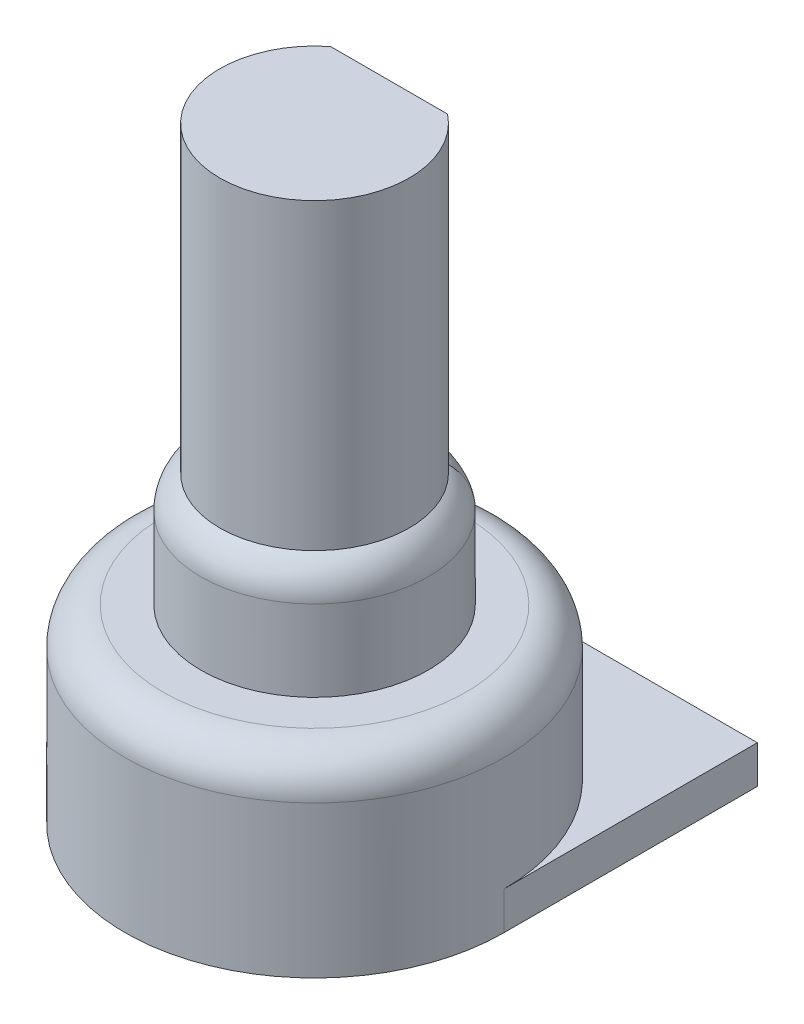
ISO-10303-21;
HEADER;
FILE_DESCRIPTION(('STEP AP214'),'2;1');
FILE_NAME('part.step','',(''),(''),'','','');
FILE_SCHEMA(('AUTOMOTIVE_DESIGN { 1 0 10303 214 1 1 1 1 }'));
ENDSEC;
DATA;
#1=APPLICATION_CONTEXT('core data for automotive mechanical design processes');
#2=APPLICATION_PROTOCOL_DEFINITION('international standard','automotive_design',2000,#1);
#3=PRODUCT_CONTEXT('',#1,'mechanical');
#4=PRODUCT('Part','Part','',(#3));
#5=PRODUCT_RELATED_PRODUCT_CATEGORY('part','',(#4));
#6=PRODUCT_DEFINITION_FORMATION('','',#4);
#7=PRODUCT_DEFINITION_CONTEXT('part definition',#1,'design');
#8=PRODUCT_DEFINITION('design','',#6,#7);
#9=PRODUCT_DEFINITION_SHAPE('','',#8);
#10=(LENGTH_UNIT() NAMED_UNIT(*) SI_UNIT(.MILLI.,.METRE.));
#11=(NAMED_UNIT(*) PLANE_ANGLE_UNIT() SI_UNIT($,.RADIAN.));
#12=(NAMED_UNIT(*) SI_UNIT($,.STERADIAN.) SOLID_ANGLE_UNIT());
#13=UNCERTAINTY_MEASURE_WITH_UNIT(LENGTH_MEASURE(1.E-05),#10,'distance_accuracy_value','');
#14=(GEOMETRIC_REPRESENTATION_CONTEXT(3) GLOBAL_UNCERTAINTY_ASSIGNED_CONTEXT((#13)) GLOBAL_UNIT_ASSIGNED_CONTEXT((#10,
#11,#12)) REPRESENTATION_CONTEXT('',''));
#15=CARTESIAN_POINT('',(0.,0.,0.));
#16=DIRECTION('',(0.,0.,1.));
#17=DIRECTION('',(1.,0.,0.));
#18=AXIS2_PLACEMENT_3D('',#15,#16,#17);
#19=CARTESIAN_POINT('',(0.,4.,0.));
#20=DIRECTION('',(0.,-1.,0.));
#21=DIRECTION('',(0.,0.,-1.));
#22=AXIS2_PLACEMENT_3D('',#19,#20,#21);
#23=CYLINDRICAL_SURFACE('',#22,5.);
#24=CARTESIAN_POINT('',(0.,3.,0.));
#25=DIRECTION('',(0.,1.,0.));
#26=DIRECTION('',(0.,0.,1.));
#27=AXIS2_PLACEMENT_3D('',#24,#25,#26);
#28=CIRCLE('',#27,5.);
#29=CARTESIAN_POINT('',(0.,3.,5.));
#30=VERTEX_POINT('',#29);
#31=EDGE_CURVE('E11',#30,#30,#28,.F.);
#32=ORIENTED_EDGE('',*,*,#31,.T.);
#33=EDGE_LOOP('',(#32));
#34=FACE_BOUND('',#33,.T.);
#35=CARTESIAN_POINT('',(0.,0.,0.));
#36=DIRECTION('',(0.,1.,0.));
#37=DIRECTION('',(0.,0.,1.));
#38=AXIS2_PLACEMENT_3D('',#35,#36,#37);
#39=CIRCLE('',#38,5.);
#40=CARTESIAN_POINT('',(5.,0.,0.));
#41=VERTEX_POINT('',#40);
#42=CARTESIAN_POINT('',(-5.,0.,0.));
#43=VERTEX_POINT('',#42);
#44=EDGE_CURVE('E140',#41,#43,#39,.T.);
#45=ORIENTED_EDGE('',*,*,#44,.T.);
#46=DIRECTION('',(0.,1.,0.));
#47=VECTOR('',#46,1.);
#48=CARTESIAN_POINT('',(-5.,-1.,0.));
#49=LINE('',#48,#47);
#50=CARTESIAN_POINT('',(-5.,-1.,0.));
#51=VERTEX_POINT('',#50);
#52=EDGE_CURVE('E122',#51,#43,#49,.T.);
#53=ORIENTED_EDGE('',*,*,#52,.F.);
#54=CARTESIAN_POINT('',(0.,-1.,0.));
#55=DIRECTION('',(0.,-1.,0.));
#56=DIRECTION('',(0.,0.,-1.));
#57=AXIS2_PLACEMENT_3D('',#54,#55,#56);
#58=CIRCLE('',#57,5.);
#59=CARTESIAN_POINT('',(5.,-1.,0.));
#60=VERTEX_POINT('',#59);
#61=EDGE_CURVE('E129',#60,#51,#58,.T.);
#62=ORIENTED_EDGE('',*,*,#61,.F.);
#63=DIRECTION('',(0.,1.,0.));
#64=VECTOR('',#63,1.);
#65=CARTESIAN_POINT('',(5.,-1.,0.));
#66=LINE('',#65,#64);
#67=EDGE_CURVE('E440',#60,#41,#66,.T.);
#68=ORIENTED_EDGE('',*,*,#67,.T.);
#69=EDGE_LOOP('',(#45,#53,#62,#68));
#70=FACE_BOUND('',#69,.T.);
#71=ADVANCED_FACE('F41',(#34,#70),#23,.T.);
#72=CARTESIAN_POINT('',(0.,4.,0.));
#73=DIRECTION('',(0.,1.,0.));
#74=DIRECTION('',(0.,0.,1.));
#75=AXIS2_PLACEMENT_3D('',#72,#73,#74);
#76=PLANE('',#75);
#77=CARTESIAN_POINT('',(0.,4.,0.));
#78=DIRECTION('',(0.,1.,0.));
#79=DIRECTION('',(0.,0.,1.));
#80=AXIS2_PLACEMENT_3D('',#77,#78,#79);
#81=CIRCLE('',#80,4.);
#82=CARTESIAN_POINT('',(0.,4.,4.));
#83=VERTEX_POINT('',#82);
#84=EDGE_CURVE('E55',#83,#83,#81,.T.);
#85=ORIENTED_EDGE('',*,*,#84,.T.);
#86=EDGE_LOOP('',(#85));
#87=FACE_BOUND('',#86,.T.);
#88=CARTESIAN_POINT('',(0.,4.,0.));
#89=DIRECTION('',(0.,1.,0.));
#90=DIRECTION('',(0.,0.,1.));
#91=AXIS2_PLACEMENT_3D('',#88,#89,#90);
#92=CIRCLE('',#91,3.);
#93=CARTESIAN_POINT('',(0.,4.,3.));
#94=VERTEX_POINT('',#93);
#95=EDGE_CURVE('E166',#94,#94,#92,.T.);
#96=ORIENTED_EDGE('',*,*,#95,.F.);
#97=EDGE_LOOP('',(#96));
#98=FACE_BOUND('',#97,.T.);
#99=ADVANCED_FACE('F261',(#87,#98),#76,.T.);
#100=CARTESIAN_POINT('',(0.,7.,0.));
#101=DIRECTION('',(0.,-1.,0.));
#102=DIRECTION('',(0.,0.,-1.));
#103=AXIS2_PLACEMENT_3D('',#100,#101,#102);
#104=CYLINDRICAL_SURFACE('',#103,3.);
#105=CARTESIAN_POINT('',(0.520536730955205,6.00000185481496,-2.95449513652104));
#106=CARTESIAN_POINT('',(0.520866478677693,7.00190042560644,-2.95443704002957));
#107=CARTESIAN_POINT('',(0.34702448730347,7.,-1.96773738528131));
#108=CARTESIAN_POINT('',(0.441593581367729,6.00004804070776,-2.96840982371977));
#109=CARTESIAN_POINT('',(0.443111767542616,7.01117760918691,-2.96816485333394));
#110=CARTESIAN_POINT('',(0.294395720911826,7.,-1.96773738528131));
#111=CARTESIAN_POINT('',(0.362095419441794,6.00016338038876,-2.97914757543754));
#112=CARTESIAN_POINT('',(0.364266822784042,7.0185579670105,-2.97888568402042));
#113=CARTESIAN_POINT('',(0.241396946294536,7.,-1.96773738528131));
#114=CARTESIAN_POINT('',(0.202507229943598,6.00038369481147,-2.99422867682402));
#115=CARTESIAN_POINT('',(0.204408943881679,7.02913501711683,-2.99410586400433));
#116=CARTESIAN_POINT('',(0.135004819962402,7.,-1.96773738528131));
#117=CARTESIAN_POINT('',(0.122417296463766,6.0004886711644,-2.99857302196224));
#118=CARTESIAN_POINT('',(0.123726572542678,7.0322880414774,-2.99854136217971));
#119=CARTESIAN_POINT('',(0.081611530975844,7.,-1.96773738528131));
#120=CARTESIAN_POINT('',(-0.0380014128020886,6.00053973802375,-3.00083311274722));
#121=CARTESIAN_POINT('',(-0.0384429477929129,7.03392549619115,-3.00085257577568));
#122=CARTESIAN_POINT('',(-0.0253342752013923,7.,-1.96773738528131));
#123=CARTESIAN_POINT('',(-0.118330361291309,6.00048555017604,-2.99873759575255));
#124=CARTESIAN_POINT('',(-0.119563078182976,7.03239431842228,-2.99870633664577));
#125=CARTESIAN_POINT('',(-0.0788869075275358,7.,-1.96773738528131));
#126=CARTESIAN_POINT('',(-0.278540894734522,6.00029204223053,-2.98812245021221));
#127=CARTESIAN_POINT('',(-0.280797306740903,7.02483286094368,-2.98792258937905));
#128=CARTESIAN_POINT('',(-0.185693929823019,7.,-1.96773738528131));
#129=CARTESIAN_POINT('',(-0.358422422762836,6.00015271153754,-2.97960202211978));
#130=CARTESIAN_POINT('',(-0.360561317383512,7.01883509205709,-2.97933171153417));
#131=CARTESIAN_POINT('',(-0.238948281841907,7.,-1.96773738528131));
#132=CARTESIAN_POINT('',(-0.604916968273584,5.99986136136218,-2.94321134432996));
#133=CARTESIAN_POINT('',(-0.603321973028898,6.99424585385075,-2.94335285985292));
#134=CARTESIAN_POINT('',(-0.403277978849022,7.,-1.96773738528131));
#135=CARTESIAN_POINT('',(-0.770116120244987,5.99986450826658,-2.90436493879673));
#136=CARTESIAN_POINT('',(-0.761399531485154,6.96929003646405,-2.90604258476055));
#137=CARTESIAN_POINT('',(-0.513410746829803,7.,-1.96773738528131));
#138=CARTESIAN_POINT('',(-1.0107665612959,6.00337649365589,-2.82586306249988));
#139=CARTESIAN_POINT('',(-0.985816481229574,6.92682606879379,-2.83457367755046));
#140=CARTESIAN_POINT('',(-0.673844374197358,7.,-1.96773738528131));
#141=CARTESIAN_POINT('',(-1.089755064957,6.00512998409455,-2.79634312323572));
#142=CARTESIAN_POINT('',(-1.0574304549066,6.91209134671317,-2.80865348995189));
#143=CARTESIAN_POINT('',(-0.726503376638275,7.,-1.96773738528131));
#144=CARTESIAN_POINT('',(-1.2449679604129,6.01064829669748,-2.73077804190997));
#145=CARTESIAN_POINT('',(-1.1955612347157,6.88273379459544,-2.75296957265926));
#146=CARTESIAN_POINT('',(-0.829978640275815,7.,-1.96773738528131));
#147=CARTESIAN_POINT('',(-1.32118868440509,6.01441569071306,-2.6947245952484));
#148=CARTESIAN_POINT('',(-1.26204903395089,6.86813199229922,-2.72330778010455));
#149=CARTESIAN_POINT('',(-0.880792456270707,7.,-1.96773738528131));
#150=CARTESIAN_POINT('',(-1.49683889255242,6.02680002500112,-2.60240946048128));
#151=CARTESIAN_POINT('',(-1.41222656205397,6.83568607536007,-2.65020284238384));
#152=CARTESIAN_POINT('',(-0.997892595034067,7.,-1.96773738528131));
#153=CARTESIAN_POINT('',(-1.59473599739624,6.0366751762618,-2.54354702756349));
#154=CARTESIAN_POINT('',(-1.49425235326483,6.81838537266106,-2.60547222437865));
#155=CARTESIAN_POINT('',(-1.06315733159436,7.,-1.96773738528131));
#156=CARTESIAN_POINT('',(-1.78127176172879,6.06472466658216,-2.4165509511928));
#157=CARTESIAN_POINT('',(-1.64789697761353,6.79029276924094,-2.51365413541539));
#158=CARTESIAN_POINT('',(-1.18751450782232,7.,-1.96773738528131));
#159=CARTESIAN_POINT('',(-1.86993388273407,6.08287731199141,-2.34844186700449));
#160=CARTESIAN_POINT('',(-1.71989389678099,6.77931893660457,-2.46655075085646));
#161=CARTESIAN_POINT('',(-1.24662258850099,7.,-1.96773738528131));
#162=CARTESIAN_POINT('',(-2.01715536851535,6.12520709809932,-2.22223595737964));
#163=CARTESIAN_POINT('',(-1.83860248576504,6.76772090333514,-2.38339245479106));
#164=CARTESIAN_POINT('',(-1.34477024566784,7.,-1.96773738528131));
#165=CARTESIAN_POINT('',(-2.07804915740135,6.1471850960162,-2.16522603471619));
#166=CARTESIAN_POINT('',(-1.88746173995959,6.76526595340393,-2.34720413326324));
#167=CARTESIAN_POINT('',(-1.38536610490388,7.,-1.96773738528131));
#168=CARTESIAN_POINT('',(-2.19106502130115,6.19908935175777,-2.05077493747291));
#169=CARTESIAN_POINT('',(-1.97805803521656,6.76631377875432,-2.27734965434905));
#170=CARTESIAN_POINT('',(-1.46071001423106,7.,-1.96773738528131));
#171=CARTESIAN_POINT('',(-2.24320347633979,6.22900049099406,-1.99333478304363));
#172=CARTESIAN_POINT('',(-2.02003387684532,6.76973929277149,-2.24353871025836));
#173=CARTESIAN_POINT('',(-1.49546898433857,7.,-1.96773738528131));
#174=CARTESIAN_POINT('',(-2.33783734794184,6.29744918290336,-1.8814639285082));
#175=CARTESIAN_POINT('',(-2.09658664625594,6.78234524835363,-2.18021950981289));
#176=CARTESIAN_POINT('',(-1.55855823184881,7.,-1.96773738528131));
#177=CARTESIAN_POINT('',(-2.38030021219654,6.33601501413118,-1.827043840268));
#178=CARTESIAN_POINT('',(-2.13133408945241,6.79152127164996,-2.15057868326884));
#179=CARTESIAN_POINT('',(-1.58686680771112,7.,-1.96773738528131));
#180=CARTESIAN_POINT('',(-2.43630868322114,6.4000538182913,-1.75083485079543));
#181=CARTESIAN_POINT('',(-2.17764823858885,6.80887640415052,-2.11053771162167));
#182=CARTESIAN_POINT('',(-1.62420578902638,7.,-1.96773738528131));
#183=CARTESIAN_POINT('',(-2.45377095581173,6.42257172549462,-1.72621631559289));
#184=CARTESIAN_POINT('',(-2.19218074302713,6.81529733628159,-2.09787211883546));
#185=CARTESIAN_POINT('',(-1.63584730448495,7.,-1.96773738528131));
#186=CARTESIAN_POINT('',(-2.48606625164954,6.4695056951382,-1.6793685612786));
#187=CARTESIAN_POINT('',(-2.21922788421847,6.82915316210739,-2.07419157865265));
#188=CARTESIAN_POINT('',(-1.65737750200288,7.,-1.96773738528131));
#189=CARTESIAN_POINT('',(-2.50089687105642,6.4939234639934,-1.65714153387007));
#190=CARTESIAN_POINT('',(-2.23175293189512,6.83659196409174,-2.06316759696406));
#191=CARTESIAN_POINT('',(-1.66726458150155,7.,-1.96773738528131));
#192=CARTESIAN_POINT('',(-2.51442587267734,6.51920505821258,-1.63635648035835));
#193=CARTESIAN_POINT('',(-2.24325860856835,6.84444657878525,-2.053032182067));
#194=CARTESIAN_POINT('',(-1.67628391511823,7.,-1.96773738528131));
#195=(BOUNDED_SURFACE() B_SPLINE_SURFACE(3,2,((#105,#106,#107),(#108,#109,#110),(#111,#112,
#113),(#114,#115,#116),(#117,#118,#119),(#120,#121,#122),(#123,#124,#125),(#126,#127,#128),
(#129,#130,#131),(#132,#133,#134),(#135,#136,#137),(#138,#139,#140),(#141,#142,#143),(#144,#145,
#146),(#147,#148,#149),(#150,#151,#152),(#153,#154,#155),(#156,#157,#158),(#159,#160,#161),
(#162,#163,#164),(#165,#166,#167),(#168,#169,#170),(#171,#172,#173),(#174,#175,#176),(#177,#178,
#179),(#180,#181,#182),(#183,#184,#185),(#186,#187,#188),(#189,#190,#191),(#192,#193,#194)),
.UNSPECIFIED.,.F.,.F.,.F.) B_SPLINE_SURFACE_WITH_KNOTS((4,2,2,2,2,2,2,2,2,2,2,2,2,2,4),(3,3),
(0.,0.160271522001961,0.320518086682756,0.481045065139428,0.641592023640548,0.97903210574132,
1.14758716675788,1.31635799669957,1.5459359947314,1.77491574267151,1.95359898264478,
2.13194411373039,2.31088068523095,2.40134046753742,2.49188245820315),(0.,1.),
.UNSPECIFIED.) GEOMETRIC_REPRESENTATION_ITEM() RATIONAL_B_SPLINE_SURFACE(((1.,0.706435834187672,
1.),(1.,0.703185029715501,1.),(1.,0.70063355501786,1.),(1.,0.697018580903054,1.),(1.,
0.695954849841734,1.),(1.,0.695403128588577,1.),(1.,0.695917899026356,1.),(1.,0.698484075012688,
1.),(1.,0.700535671811073,1.),(1.,0.709123066734792,1.),(1.,0.718108994217175,1.),(1.,
0.734562553880553,1.),(1.,0.740539198644847,1.),(1.,0.753102901283008,1.),(1.,0.759690730758651,
1.),(1.,0.775479132783039,1.),(1.,0.784765882562336,1.),(1.,0.802612772782072,1.),(1.,
0.811174743608809,1.),(1.,0.824906148705264,1.),(1.,0.830407669954603,1.),(1.,0.840030863544463,
1.),(1.,0.844155127171257,1.),(1.,0.85092578889602,1.),(1.,0.853567240637306,1.),(1.,
0.856545417498974,1.),(1.,0.857375927704215,1.),(1.,0.858752845010317,1.),(1.,0.859298993237049,
1.),(1.,0.859729750965828,1.))) REPRESENTATION_ITEM('') SURFACE());
#196=CARTESIAN_POINT('',(-2.51442587267734,6.51920505821258,-1.63635648035835));
#197=CARTESIAN_POINT('',(-2.50089687105642,6.4939234639934,-1.65714153387007));
#198=CARTESIAN_POINT('',(-2.48606625164954,6.4695056951382,-1.6793685612786));
#199=CARTESIAN_POINT('',(-2.45377095581173,6.42257172549462,-1.72621631559289));
#200=CARTESIAN_POINT('',(-2.43630868322114,6.4000538182913,-1.75083485079543));
#201=CARTESIAN_POINT('',(-2.38030021219654,6.33601501413118,-1.827043840268));
#202=CARTESIAN_POINT('',(-2.33783734794184,6.29744918290336,-1.8814639285082));
#203=CARTESIAN_POINT('',(-2.24320347633979,6.22900049099406,-1.99333478304363));
#204=CARTESIAN_POINT('',(-2.19106502130115,6.19908935175777,-2.05077493747291));
#205=CARTESIAN_POINT('',(-2.07804915740135,6.1471850960162,-2.16522603471619));
#206=CARTESIAN_POINT('',(-2.01715536851535,6.12520709809932,-2.22223595737964));
#207=CARTESIAN_POINT('',(-1.86993388273407,6.08287731199141,-2.34844186700449));
#208=CARTESIAN_POINT('',(-1.78127176172879,6.06472466658216,-2.4165509511928));
#209=CARTESIAN_POINT('',(-1.59473599739624,6.0366751762618,-2.54354702756349));
#210=CARTESIAN_POINT('',(-1.49683889255242,6.02680002500112,-2.60240946048128));
#211=CARTESIAN_POINT('',(-1.32118868440509,6.01441569071306,-2.6947245952484));
#212=CARTESIAN_POINT('',(-1.2449679604129,6.01064829669748,-2.73077804190997));
#213=CARTESIAN_POINT('',(-1.089755064957,6.00512998409455,-2.79634312323572));
#214=CARTESIAN_POINT('',(-1.0107665612959,6.00337649365589,-2.82586306249988));
#215=CARTESIAN_POINT('',(-0.770116120244987,5.99986450826658,-2.90436493879673));
#216=CARTESIAN_POINT('',(-0.604916968273584,5.99986136136218,-2.94321134432996));
#217=CARTESIAN_POINT('',(-0.358422422762836,6.00015271153754,-2.97960202211978));
#218=CARTESIAN_POINT('',(-0.278540894734522,6.00029204223053,-2.98812245021221));
#219=CARTESIAN_POINT('',(-0.118330361291309,6.00048555017604,-2.99873759575255));
#220=CARTESIAN_POINT('',(-0.0380014128020886,6.00053973802375,-3.00083311274722));
#221=CARTESIAN_POINT('',(0.122417296463766,6.0004886711644,-2.99857302196224));
#222=CARTESIAN_POINT('',(0.202507229943598,6.00038369481147,-2.99422867682402));
#223=CARTESIAN_POINT('',(0.362095419441795,6.00016338038876,-2.97914757543754));
#224=CARTESIAN_POINT('',(0.441593581367729,6.00004804070776,-2.96840982371977));
#225=CARTESIAN_POINT('',(0.520536730955205,6.00000185481496,-2.95449513652104));
#226=B_SPLINE_CURVE_WITH_KNOTS('',3,(#196,#197,#198,#199,#200,#201,#202,#203,#204,#205,#206,
#207,#208,#209,#210,#211,#212,#213,#214,#215,#216,#217,#218,#219,#220,#221,#222,#223,#224,#225),
.UNSPECIFIED.,.F.,.F.,(4,2,2,2,2,2,2,2,2,2,2,2,2,2,4),(0.,0.0905419906657322,0.1810017729722,
0.359938344472757,0.538283475558371,0.716966715531638,0.945946463471746,1.17552446150357,
1.34429529144527,1.51285035246183,1.8502904345626,2.01083739306372,2.17136437152039,
2.33161093620119,2.49188245820315),.UNSPECIFIED.);
#227=CARTESIAN_POINT('',(-2.03787405834048,6.13397459621556,-2.20160607792196));
#228=VERTEX_POINT('',#227);
#229=CARTESIAN_POINT('',(-0.536676402289272,6.,-2.95160607792196));
#230=VERTEX_POINT('',#229);
#231=EDGE_CURVE('E173',#228,#230,#226,.T.);
#232=ORIENTED_EDGE('',*,*,#231,.T.);
#233=CARTESIAN_POINT('',(0.,6.,0.));
#234=DIRECTION('',(0.,1.,0.));
#235=DIRECTION('',(0.,0.,1.));
#236=AXIS2_PLACEMENT_3D('',#233,#234,#235);
#237=CIRCLE('',#236,3.);
#238=CARTESIAN_POINT('',(0.536676402289269,6.,-2.95160607792196));
#239=VERTEX_POINT('',#238);
#240=EDGE_CURVE('E63',#230,#239,#237,.F.);
#241=ORIENTED_EDGE('',*,*,#240,.T.);
#242=CARTESIAN_POINT('',(2.47355700829104,6.45137547886523,-1.69750279137747));
#243=CARTESIAN_POINT('',(2.20876389556524,6.82381001022166,-2.08335244243966));
#244=CARTESIAN_POINT('',(1.64903800552736,7.,-1.96773738528131));
#245=CARTESIAN_POINT('',(2.44733251521866,6.41237660553013,-1.73579194848286));
#246=CARTESIAN_POINT('',(2.18674017106704,6.81218867798672,-2.10261566673093));
#247=CARTESIAN_POINT('',(1.63155501014577,7.,-1.96773738528131));
#248=CARTESIAN_POINT('',(2.41739523176251,6.37608489503801,-1.77744574962143));
#249=CARTESIAN_POINT('',(2.16188522207287,6.80205103734026,-2.1242781030629));
#250=CARTESIAN_POINT('',(1.61159682117501,7.,-1.96773738528131));
#251=CARTESIAN_POINT('',(2.35060883924748,6.30935626636143,-1.86482526115536));
#252=CARTESIAN_POINT('',(2.10711195678218,6.78527986293987,-2.17117267834912));
#253=CARTESIAN_POINT('',(1.56707255949832,7.,-1.96773738528131));
#254=CARTESIAN_POINT('',(2.31380105032395,6.27888644327347,-1.91052581237447));
#255=CARTESIAN_POINT('',(2.07713894780983,6.77862336496292,-2.1964525843594));
#256=CARTESIAN_POINT('',(1.5425340335493,7.,-1.96773738528131));
#257=CARTESIAN_POINT('',(2.23110885048495,6.22215929305744,-2.00659147495118));
#258=CARTESIAN_POINT('',(2.01034643463258,6.76898997742828,-2.25131759488844));
#259=CARTESIAN_POINT('',(1.4874059003233,7.,-1.96773738528131));
#260=CARTESIAN_POINT('',(2.18481758478538,6.19625568234982,-2.05707279383417));
#261=CARTESIAN_POINT('',(1.97311029674358,6.76627393972283,-2.2811542502516));
#262=CARTESIAN_POINT('',(1.45654505652359,7.,-1.96773738528131));
#263=CARTESIAN_POINT('',(2.08550268730714,6.150573007243,-2.15770653906294));
#264=CARTESIAN_POINT('',(1.89349531163015,6.76531831108411,-2.3425623183965));
#265=CARTESIAN_POINT('',(1.39033512487143,7.,-1.96773738528131));
#266=CARTESIAN_POINT('',(2.03246938760342,6.13080288101934,-2.20785838213827));
#267=CARTESIAN_POINT('',(1.85095594473717,6.76712994761033,-2.37423140076883));
#268=CARTESIAN_POINT('',(1.35497959173561,7.,-1.96773738528131));
#269=CARTESIAN_POINT('',(1.89326601514172,6.08832806330656,-2.32974887150156));
#270=CARTESIAN_POINT('',(1.73873720892919,6.77682010631457,-2.4538883765447));
#271=CARTESIAN_POINT('',(1.26217734342782,7.,-1.96773738528131));
#272=CARTESIAN_POINT('',(1.80357276036745,6.0689152300912,-2.40005209637092));
#273=CARTESIAN_POINT('',(1.66603890205278,6.78735979660252,-2.50211979478377));
#274=CARTESIAN_POINT('',(1.20238184024497,7.,-1.96773738528131));
#275=CARTESIAN_POINT('',(1.61441369377795,6.03895865477583,-2.53121236180606));
#276=CARTESIAN_POINT('',(1.51059803137484,6.81507666501806,-2.59627554281819));
#277=CARTESIAN_POINT('',(1.07627579585197,7.,-1.96773738528131));
#278=CARTESIAN_POINT('',(1.51492221765999,6.02843893530166,-2.59204345681305));
#279=CARTESIAN_POINT('',(1.42744039443367,6.83245452991153,-2.64223197125601));
#280=CARTESIAN_POINT('',(1.00994814510666,7.,-1.96773738528131));
#281=CARTESIAN_POINT('',(1.27322515112109,6.01060609557221,-2.72094393029416));
#282=CARTESIAN_POINT('',(1.21981260413536,6.87718922290874,-2.74455053996177));
#283=CARTESIAN_POINT('',(0.848816767414059,7.,-1.96773738528131));
#284=CARTESIAN_POINT('',(1.12811556430418,6.00564748386512,-2.78428296274231));
#285=CARTESIAN_POINT('',(1.09177827622044,6.90580660233446,-2.79812042476473));
#286=CARTESIAN_POINT('',(0.752077042869453,7.,-1.96773738528131));
#287=CARTESIAN_POINT('',(0.829533125444094,6.00031931517094,-2.88736685976144));
#288=CARTESIAN_POINT('',(0.817517224886831,6.95937275856478,-2.890181390132));
#289=CARTESIAN_POINT('',(0.553022083629396,7.,-1.96773738528131));
#290=CARTESIAN_POINT('',(0.676052934802595,5.99995385217583,-2.92709064541832));
#291=CARTESIAN_POINT('',(0.671985743343665,6.98396363596031,-2.92778752557935));
#292=CARTESIAN_POINT('',(0.450701956535063,7.,-1.96773738528131));
#293=CARTESIAN_POINT('',(0.441469538297941,6.00002626020696,-2.96842806520685));
#294=CARTESIAN_POINT('',(0.442983533858985,7.0111445812164,-2.96817150775583));
#295=CARTESIAN_POINT('',(0.294313025531961,7.,-1.96773738528131));
#296=CARTESIAN_POINT('',(0.361876059497265,6.00015754173976,-2.97917659705195));
#297=CARTESIAN_POINT('',(0.364047347339577,7.01856509159885,-2.97891146304746));
#298=CARTESIAN_POINT('',(0.241250706331511,7.,-1.96773738528131));
#299=CARTESIAN_POINT('',(0.202062466337572,6.0003905116567,-2.99426239055293));
#300=CARTESIAN_POINT('',(0.203961637708663,7.02917215624139,-2.99414354981379));
#301=CARTESIAN_POINT('',(0.134708310891715,7.,-1.96773738528131));
#302=CARTESIAN_POINT('',(0.121842327480343,6.00049219887789,-2.99859940028752));
#303=CARTESIAN_POINT('',(0.123146193912136,7.03231359528539,-2.99857001453381));
#304=CARTESIAN_POINT('',(0.0812282183202294,7.,-1.96773738528131));
#305=CARTESIAN_POINT('',(-0.0385868351381965,6.00053655667531,-3.00082294970918));
#306=CARTESIAN_POINT('',(-0.0390341666076833,7.03391161601379,-3.00084045797569));
#307=CARTESIAN_POINT('',(-0.0257245567587984,7.,-1.96773738528131));
#308=CARTESIAN_POINT('',(-0.118795757442538,6.00047941729215,-2.9987171980421));
#309=CARTESIAN_POINT('',(-0.120031352353304,7.03236654805585,-2.99868206190195));
#310=CARTESIAN_POINT('',(-0.0791971716283609,7.,-1.96773738528131));
#311=CARTESIAN_POINT('',(-0.278789275926867,6.00029729287594,-2.98809548832386));
#312=CARTESIAN_POINT('',(-0.281048423115858,7.02482679994912,-2.9878987038736));
#313=CARTESIAN_POINT('',(-0.185859517284581,7.,-1.96773738528131));
#314=CARTESIAN_POINT('',(-0.358573864057783,6.00017230656052,-2.97957940911072));
#315=CARTESIAN_POINT('',(-0.36072191433987,7.0188646875014,-2.97932069384958));
#316=CARTESIAN_POINT('',(-0.239049242705191,7.,-1.96773738528131));
#317=CARTESIAN_POINT('',(-0.43789025293174,6.00005878261831,-2.96786996453473));
#318=CARTESIAN_POINT('',(-0.439472900905556,7.01084213405776,-2.96763645493699));
#319=CARTESIAN_POINT('',(-0.291926835287827,7.,-1.96773738528131));
#320=(BOUNDED_SURFACE() B_SPLINE_SURFACE(3,2,((#242,#243,#244),(#245,#246,#247),(#248,#249,
#250),(#251,#252,#253),(#254,#255,#256),(#257,#258,#259),(#260,#261,#262),(#263,#264,#265),
(#266,#267,#268),(#269,#270,#271),(#272,#273,#274),(#275,#276,#277),(#278,#279,#280),(#281,#282,
#283),(#284,#285,#286),(#287,#288,#289),(#290,#291,#292),(#293,#294,#295),(#296,#297,#298),
(#299,#300,#301),(#302,#303,#304),(#305,#306,#307),(#308,#309,#310),(#311,#312,#313),(#314,#315,
#316),(#317,#318,#319)),.UNSPECIFIED.,.F.,.F.,.F.) B_SPLINE_SURFACE_WITH_KNOTS((4,2,2,2,2,2,2,2,
2,2,2,2,4),(3,3),(0.,0.149019327834431,0.297169736367482,0.45404419467948,0.611146199929875,
0.845065417932731,1.07961451200912,1.39499610097889,1.71065877778202,1.87114727392607,
2.03164207581049,2.19194492373374,2.35225080162659),(0.,1.),
.UNSPECIFIED.) GEOMETRIC_REPRESENTATION_ITEM() RATIONAL_B_SPLINE_SURFACE(((1.,0.858218039479021,
1.),(1.,0.857141476498481,1.),(1.,0.855638621967276,1.),(1.,0.851697235496683,1.),(1.,
0.849264210510849,1.),(1.,0.843195425149899,1.),(1.,0.839497276760322,1.),(1.,0.83104394608383,
1.),(1.,0.82628723834639,1.),(1.,0.813400540456095,1.),(1.,0.804758397784339,1.),(1.,
0.786639711958819,1.),(1.,0.777160984669837,1.),(1.,0.755313548917098,1.),(1.,0.743074650659231,
1.),(1.,0.721823550456026,1.),(1.,0.712814234066578,1.),(1.,0.703192942710168,1.),(1.,
0.700630113080969,1.),(1.,0.697006952577283,1.),(1.,0.695946680741309,1.),(1.,0.695407351324499,
1.),(1.,0.695926404106621,1.),(1.,0.698487024215212,1.),(1.,0.700528620319356,1.),(1.,
0.703304177864533,1.))) REPRESENTATION_ITEM('') SURFACE());
#321=CARTESIAN_POINT('',(-0.43789025293174,6.00005878261831,-2.96786996453473));
#322=CARTESIAN_POINT('',(-0.358573864057783,6.00017230656052,-2.97957940911072));
#323=CARTESIAN_POINT('',(-0.278789275926867,6.00029729287594,-2.98809548832385));
#324=CARTESIAN_POINT('',(-0.118795757442538,6.00047941729215,-2.9987171980421));
#325=CARTESIAN_POINT('',(-0.0385868351381965,6.00053655667531,-3.00082294970918));
#326=CARTESIAN_POINT('',(0.121842327480343,6.00049219887789,-2.99859940028752));
#327=CARTESIAN_POINT('',(0.202062466337572,6.0003905116567,-2.99426239055293));
#328=CARTESIAN_POINT('',(0.361876059497265,6.00015754173976,-2.97917659705195));
#329=CARTESIAN_POINT('',(0.441469538297941,6.00002626020696,-2.96842806520685));
#330=CARTESIAN_POINT('',(0.676052934802595,5.99995385217583,-2.92709064541832));
#331=CARTESIAN_POINT('',(0.829533125444094,6.00031931517094,-2.88736685976144));
#332=CARTESIAN_POINT('',(1.12811556430418,6.00564748386512,-2.78428296274231));
#333=CARTESIAN_POINT('',(1.27322515112109,6.01060609557221,-2.72094393029416));
#334=CARTESIAN_POINT('',(1.51492221765999,6.02843893530166,-2.59204345681305));
#335=CARTESIAN_POINT('',(1.61441369377795,6.03895865477583,-2.53121236180606));
#336=CARTESIAN_POINT('',(1.80357276036745,6.0689152300912,-2.40005209637092));
#337=CARTESIAN_POINT('',(1.89326601514172,6.08832806330656,-2.32974887150155));
#338=CARTESIAN_POINT('',(2.03246938760342,6.13080288101934,-2.20785838213827));
#339=CARTESIAN_POINT('',(2.08550268730714,6.150573007243,-2.15770653906294));
#340=CARTESIAN_POINT('',(2.18481758478538,6.19625568234982,-2.05707279383417));
#341=CARTESIAN_POINT('',(2.23110885048495,6.22215929305744,-2.00659147495118));
#342=CARTESIAN_POINT('',(2.31380105032395,6.27888644327347,-1.91052581237447));
#343=CARTESIAN_POINT('',(2.35060883924748,6.30935626636143,-1.86482526115536));
#344=CARTESIAN_POINT('',(2.41739523176251,6.37608489503801,-1.77744574962143));
#345=CARTESIAN_POINT('',(2.44733251521866,6.41237660553013,-1.73579194848286));
#346=CARTESIAN_POINT('',(2.47355700829104,6.45137547886523,-1.69750279137747));
#347=B_SPLINE_CURVE_WITH_KNOTS('',3,(#321,#322,#323,#324,#325,#326,#327,#328,#329,#330,#331,
#332,#333,#334,#335,#336,#337,#338,#339,#340,#341,#342,#343,#344,#345,#346),.UNSPECIFIED.,.F.,
.F.,(4,2,2,2,2,2,2,2,2,2,2,2,4),(0.,0.160305877892846,0.320608725816097,0.481103527700511,
0.641592023844569,0.957254700647695,1.27263628961746,1.50718538369385,1.74110460169671,
1.89820660694711,2.0550810652591,2.20323147379215,2.35225080162659),.UNSPECIFIED.);
#348=CARTESIAN_POINT('',(2.03787405834047,6.13397459621556,-2.20160607792196));
#349=VERTEX_POINT('',#348);
#350=EDGE_CURVE('E67',#239,#349,#347,.T.);
#351=ORIENTED_EDGE('',*,*,#350,.T.);
#352=CARTESIAN_POINT('',(0.,6.13397459621556,0.));
#353=DIRECTION('',(0.,1.,0.));
#354=DIRECTION('',(0.,0.,1.));
#355=AXIS2_PLACEMENT_3D('',#352,#353,#354);
#356=CIRCLE('',#355,3.);
#357=EDGE_CURVE('E175',#349,#228,#356,.F.);
#358=ORIENTED_EDGE('',*,*,#357,.T.);
#359=EDGE_LOOP('',(#232,#241,#351,#358));
#360=FACE_BOUND('',#359,.T.);
#361=ORIENTED_EDGE('',*,*,#95,.T.);
#362=EDGE_LOOP('',(#361));
#363=FACE_BOUND('',#362,.T.);
#364=ADVANCED_FACE('F184',(#360,#363),#104,.T.);
#365=CARTESIAN_POINT('',(0.,7.,0.));
#366=DIRECTION('',(0.,1.,0.));
#367=DIRECTION('',(0.,0.,1.));
#368=AXIS2_PLACEMENT_3D('',#365,#366,#367);
#369=PLANE('',#368);
#370=DIRECTION('',(1.,0.,0.));
#371=VECTOR('',#370,1.);
#372=CARTESIAN_POINT('',(-1.96780354474308,7.,-1.96773738528131));
#373=LINE('',#372,#371);
#374=CARTESIAN_POINT('',(-0.357784268192847,7.,-1.96773738528131));
#375=VERTEX_POINT('',#374);
#376=CARTESIAN_POINT('',(0.357784268192847,7.,-1.96773738528131));
#377=VERTEX_POINT('',#376);
#378=EDGE_CURVE('E144',#375,#377,#373,.T.);
#379=ORIENTED_EDGE('',*,*,#378,.T.);
#380=CARTESIAN_POINT('',(0.,7.,0.));
#381=DIRECTION('',(0.,1.,0.));
#382=DIRECTION('',(0.,0.,1.));
#383=AXIS2_PLACEMENT_3D('',#380,#381,#382);
#384=CIRCLE('',#383,2.);
#385=EDGE_CURVE('E171',#377,#375,#384,.T.);
#386=ORIENTED_EDGE('',*,*,#385,.T.);
#387=EDGE_LOOP('',(#379,#386));
#388=FACE_BOUND('',#387,.T.);
#389=ADVANCED_FACE('F277',(#388),#369,.T.);
#390=CARTESIAN_POINT('',(0.,15.,0.));
#391=DIRECTION('',(0.,-1.,0.));
#392=DIRECTION('',(0.,0.,-1.));
#393=AXIS2_PLACEMENT_3D('',#390,#391,#392);
#394=CYLINDRICAL_SURFACE('',#393,2.5);
#395=CARTESIAN_POINT('',(0.,15.,0.));
#396=DIRECTION('',(0.,1.,0.));
#397=DIRECTION('',(0.,0.,1.));
#398=AXIS2_PLACEMENT_3D('',#395,#396,#397);
#399=CIRCLE('',#398,2.5);
#400=CARTESIAN_POINT('',(-1.54207962912629,15.,-1.96773738528131));
#401=VERTEX_POINT('',#400);
#402=CARTESIAN_POINT('',(1.54207962912629,15.,-1.96773738528131));
#403=VERTEX_POINT('',#402);
#404=EDGE_CURVE('E158',#401,#403,#399,.T.);
#405=ORIENTED_EDGE('',*,*,#404,.F.);
#406=DIRECTION('',(0.,-1.,0.));
#407=VECTOR('',#406,1.);
#408=CARTESIAN_POINT('',(-1.54207962912629,15.,-1.96773738528131));
#409=LINE('',#408,#407);
#410=CARTESIAN_POINT('',(-1.54207962912629,7.,-1.96773738528131));
#411=VERTEX_POINT('',#410);
#412=EDGE_CURVE('E155',#401,#411,#409,.T.);
#413=ORIENTED_EDGE('',*,*,#412,.T.);
#414=CARTESIAN_POINT('',(0.,7.,0.));
#415=DIRECTION('',(0.,1.,0.));
#416=DIRECTION('',(0.,0.,1.));
#417=AXIS2_PLACEMENT_3D('',#414,#415,#416);
#418=CIRCLE('',#417,2.5);
#419=CARTESIAN_POINT('',(1.54207962912629,7.,-1.96773738528131));
#420=VERTEX_POINT('',#419);
#421=EDGE_CURVE('E162',#411,#420,#418,.T.);
#422=ORIENTED_EDGE('',*,*,#421,.T.);
#423=DIRECTION('',(0.,-1.,0.));
#424=VECTOR('',#423,1.);
#425=CARTESIAN_POINT('',(1.54207962912629,15.,-1.96773738528131));
#426=LINE('',#425,#424);
#427=EDGE_CURVE('E152',#420,#403,#426,.F.);
#428=ORIENTED_EDGE('',*,*,#427,.T.);
#429=EDGE_LOOP('',(#405,#413,#422,#428));
#430=FACE_BOUND('',#429,.T.);
#431=ADVANCED_FACE('F281',(#430),#394,.T.);
#432=CARTESIAN_POINT('',(0.,15.,0.));
#433=DIRECTION('',(0.,1.,0.));
#434=DIRECTION('',(0.,0.,1.));
#435=AXIS2_PLACEMENT_3D('',#432,#433,#434);
#436=PLANE('',#435);
#437=DIRECTION('',(1.,0.,0.));
#438=VECTOR('',#437,1.);
#439=CARTESIAN_POINT('',(0.,15.,-1.96773738528131));
#440=LINE('',#439,#438);
#441=EDGE_CURVE('E165',#401,#403,#440,.T.);
#442=ORIENTED_EDGE('',*,*,#441,.F.);
#443=ORIENTED_EDGE('',*,*,#404,.T.);
#444=EDGE_LOOP('',(#442,#443));
#445=FACE_BOUND('',#444,.T.);
#446=ADVANCED_FACE('F286',(#445),#436,.T.);
#447=CARTESIAN_POINT('',(-1.96780354474308,7.,-1.96773738528131));
#448=DIRECTION('',(0.,0.,1.));
#449=DIRECTION('',(1.,0.,0.));
#450=AXIS2_PLACEMENT_3D('',#447,#448,#449);
#451=PLANE('',#450);
#452=ORIENTED_EDGE('',*,*,#441,.T.);
#453=ORIENTED_EDGE('',*,*,#427,.F.);
#454=EDGE_CURVE('E141',#377,#420,#373,.T.);
#455=ORIENTED_EDGE('',*,*,#454,.F.);
#456=ORIENTED_EDGE('',*,*,#378,.F.);
#457=EDGE_CURVE('E146',#411,#375,#373,.T.);
#458=ORIENTED_EDGE('',*,*,#457,.F.);
#459=ORIENTED_EDGE('',*,*,#412,.F.);
#460=EDGE_LOOP('',(#452,#453,#455,#456,#458,#459));
#461=FACE_BOUND('',#460,.T.);
#462=ADVANCED_FACE('F293',(#461),#451,.F.);
#463=CARTESIAN_POINT('',(-5.,-1.,0.));
#464=DIRECTION('',(1.,0.,0.));
#465=DIRECTION('',(0.,0.,-1.));
#466=AXIS2_PLACEMENT_3D('',#463,#464,#465);
#467=PLANE('',#466);
#468=DIRECTION('',(0.,0.,-1.));
#469=VECTOR('',#468,1.);
#470=CARTESIAN_POINT('',(-5.,0.,0.));
#471=LINE('',#470,#469);
#472=CARTESIAN_POINT('',(-5.,0.,-6.68645036232717));
#473=VERTEX_POINT('',#472);
#474=EDGE_CURVE('E228',#43,#473,#471,.T.);
#475=ORIENTED_EDGE('',*,*,#474,.T.);
#476=DIRECTION('',(0.,1.,0.));
#477=VECTOR('',#476,1.);
#478=CARTESIAN_POINT('',(-5.,-1.,-6.68645036232717));
#479=LINE('',#478,#477);
#480=CARTESIAN_POINT('',(-5.,-1.,-6.68645036232717));
#481=VERTEX_POINT('',#480);
#482=EDGE_CURVE('E125',#481,#473,#479,.T.);
#483=ORIENTED_EDGE('',*,*,#482,.F.);
#484=DIRECTION('',(0.,0.,-1.));
#485=VECTOR('',#484,1.);
#486=CARTESIAN_POINT('',(-5.,-1.,0.));
#487=LINE('',#486,#485);
#488=EDGE_CURVE('E118',#51,#481,#487,.T.);
#489=ORIENTED_EDGE('',*,*,#488,.F.);
#490=ORIENTED_EDGE('',*,*,#52,.T.);
#491=EDGE_LOOP('',(#475,#483,#489,#490));
#492=FACE_BOUND('',#491,.T.);
#493=ADVANCED_FACE('F120',(#492),#467,.F.);
#494=CARTESIAN_POINT('',(-5.,-1.,-6.68645036232717));
#495=DIRECTION('',(0.,0.,1.));
#496=DIRECTION('',(1.,0.,0.));
#497=AXIS2_PLACEMENT_3D('',#494,#495,#496);
#498=PLANE('',#497);
#499=DIRECTION('',(1.,0.,0.));
#500=VECTOR('',#499,1.);
#501=CARTESIAN_POINT('',(-5.,0.,-6.68645036232717));
#502=LINE('',#501,#500);
#503=CARTESIAN_POINT('',(5.,0.,-6.68645036232717));
#504=VERTEX_POINT('',#503);
#505=EDGE_CURVE('E433',#473,#504,#502,.T.);
#506=ORIENTED_EDGE('',*,*,#505,.T.);
#507=DIRECTION('',(0.,1.,0.));
#508=VECTOR('',#507,1.);
#509=CARTESIAN_POINT('',(5.,-1.,-6.68645036232717));
#510=LINE('',#509,#508);
#511=CARTESIAN_POINT('',(5.,-1.,-6.68645036232717));
#512=VERTEX_POINT('',#511);
#513=EDGE_CURVE('E147',#512,#504,#510,.T.);
#514=ORIENTED_EDGE('',*,*,#513,.F.);
#515=DIRECTION('',(1.,0.,0.));
#516=VECTOR('',#515,1.);
#517=CARTESIAN_POINT('',(-5.,-1.,-6.68645036232717));
#518=LINE('',#517,#516);
#519=EDGE_CURVE('E128',#481,#512,#518,.T.);
#520=ORIENTED_EDGE('',*,*,#519,.F.);
#521=ORIENTED_EDGE('',*,*,#482,.T.);
#522=EDGE_LOOP('',(#506,#514,#520,#521));
#523=FACE_BOUND('',#522,.T.);
#524=ADVANCED_FACE('F301',(#523),#498,.F.);
#525=CARTESIAN_POINT('',(5.,-1.,0.));
#526=DIRECTION('',(-1.,0.,0.));
#527=DIRECTION('',(0.,0.,1.));
#528=AXIS2_PLACEMENT_3D('',#525,#526,#527);
#529=PLANE('',#528);
#530=DIRECTION('',(0.,0.,1.));
#531=VECTOR('',#530,1.);
#532=CARTESIAN_POINT('',(5.,0.,0.));
#533=LINE('',#532,#531);
#534=EDGE_CURVE('E137',#504,#41,#533,.T.);
#535=ORIENTED_EDGE('',*,*,#534,.T.);
#536=ORIENTED_EDGE('',*,*,#67,.F.);
#537=DIRECTION('',(0.,0.,1.));
#538=VECTOR('',#537,1.);
#539=CARTESIAN_POINT('',(5.,-1.,0.));
#540=LINE('',#539,#538);
#541=EDGE_CURVE('E134',#512,#60,#540,.T.);
#542=ORIENTED_EDGE('',*,*,#541,.F.);
#543=ORIENTED_EDGE('',*,*,#513,.T.);
#544=EDGE_LOOP('',(#535,#536,#542,#543));
#545=FACE_BOUND('',#544,.T.);
#546=ADVANCED_FACE('F304',(#545),#529,.F.);
#547=CARTESIAN_POINT('',(0.,-1.,0.));
#548=DIRECTION('',(0.,-1.,0.));
#549=DIRECTION('',(0.,0.,-1.));
#550=AXIS2_PLACEMENT_3D('',#547,#548,#549);
#551=PLANE('',#550);
#552=ORIENTED_EDGE('',*,*,#61,.T.);
#553=ORIENTED_EDGE('',*,*,#488,.T.);
#554=ORIENTED_EDGE('',*,*,#519,.T.);
#555=ORIENTED_EDGE('',*,*,#541,.T.);
#556=EDGE_LOOP('',(#552,#553,#554,#555));
#557=FACE_BOUND('',#556,.T.);
#558=ADVANCED_FACE('F132',(#557),#551,.T.);
#559=CARTESIAN_POINT('',(0.,0.,0.));
#560=DIRECTION('',(0.,-1.,0.));
#561=DIRECTION('',(0.,0.,-1.));
#562=AXIS2_PLACEMENT_3D('',#559,#560,#561);
#563=PLANE('',#562);
#564=ORIENTED_EDGE('',*,*,#44,.F.);
#565=ORIENTED_EDGE('',*,*,#534,.F.);
#566=ORIENTED_EDGE('',*,*,#505,.F.);
#567=ORIENTED_EDGE('',*,*,#474,.F.);
#568=EDGE_LOOP('',(#564,#565,#566,#567));
#569=FACE_BOUND('',#568,.T.);
#570=ADVANCED_FACE('F309',(#569),#563,.F.);
#571=CARTESIAN_POINT('',(1.54207962912633,7.00000000000001,-1.96773738528126));
#572=CARTESIAN_POINT('',(1.57442801921985,6.97819164447182,-1.99042670097147));
#573=CARTESIAN_POINT('',(1.60574773816073,6.9538237033385,-2.0120931352787));
#574=CARTESIAN_POINT('',(1.66606736969322,6.90040735402389,-2.05282334342047));
#575=CARTESIAN_POINT('',(1.69506492502949,6.87135427782812,-2.07188448612092));
#576=CARTESIAN_POINT('',(1.75839515144109,6.80006523825286,-2.11183565401948));
#577=CARTESIAN_POINT('',(1.79185361558165,6.7564441195967,-2.13166692584363));
#578=CARTESIAN_POINT('',(1.85351865003883,6.66349547381702,-2.16524224002423));
#579=CARTESIAN_POINT('',(1.88172289838099,6.6141654393138,-2.17898359476973));
#580=CARTESIAN_POINT('',(1.93086253115223,6.51386428350274,-2.1993078621377));
#581=CARTESIAN_POINT('',(1.95209501680778,6.46310478311716,-2.20621978436001));
#582=CARTESIAN_POINT('',(1.98864262683629,6.35913843732197,-2.21380118967728));
#583=CARTESIAN_POINT('',(2.00396835740003,6.30593617228212,-2.21448191203241));
#584=CARTESIAN_POINT('',(2.02411668953296,6.21722987325003,-2.21041071014162));
#585=CARTESIAN_POINT('',(2.0307381267436,6.18203578990071,-2.20747353441671));
#586=CARTESIAN_POINT('',(2.03665218342658,6.14253561136039,-2.20269919470591));
#587=CARTESIAN_POINT('',(2.0372731009414,6.13825511475445,-2.20216237088408));
#588=CARTESIAN_POINT('',(2.03787405834047,6.13397459621557,-2.20160607792196));
#589=B_SPLINE_CURVE_WITH_KNOTS('',3,(#571,#572,#573,#574,#575,#576,#577,#578,#579,#580,#581,
#582,#583,#584,#585,#586,#587,#588),.UNSPECIFIED.,.F.,.F.,(4,2,2,2,2,2,2,2,4),(0.,
0.1352719778315,0.270679575639611,0.445150555017464,0.619698455689919,0.785354408160628,
0.95071150678875,1.0583033554017,1.07137843773992),.UNSPECIFIED.);
#590=EDGE_CURVE('E229',#349,#420,#589,.F.);
#591=ORIENTED_EDGE('',*,*,#590,.F.);
#592=ORIENTED_EDGE('',*,*,#350,.F.);
#593=CARTESIAN_POINT('',(0.357784268192846,6.,-1.96773738528131));
#594=DIRECTION('',(-0.983868692640653,0.,-0.178892134096423));
#595=DIRECTION('',(-0.178892134096423,0.,0.983868692640653));
#596=AXIS2_PLACEMENT_3D('',#593,#594,#595);
#597=CIRCLE('',#596,1.);
#598=EDGE_CURVE('E225',#377,#239,#597,.T.);
#599=ORIENTED_EDGE('',*,*,#598,.F.);
#600=ORIENTED_EDGE('',*,*,#454,.T.);
#601=EDGE_LOOP('',(#591,#592,#599,#600));
#602=FACE_BOUND('',#601,.T.);
#603=ADVANCED_FACE('F217',(#602),#320,.T.);
#604=CARTESIAN_POINT('',(0.,6.,0.));
#605=DIRECTION('',(0.,1.,0.));
#606=DIRECTION('',(0.,0.,1.));
#607=AXIS2_PLACEMENT_3D('',#604,#605,#606);
#608=TOROIDAL_SURFACE('',#607,2.,1.);
#609=ORIENTED_EDGE('',*,*,#598,.T.);
#610=ORIENTED_EDGE('',*,*,#240,.F.);
#611=CARTESIAN_POINT('',(-0.357784268192848,6.,-1.96773738528131));
#612=DIRECTION('',(-0.983868692640653,0.,0.178892134096424));
#613=DIRECTION('',(0.178892134096424,0.,0.983868692640653));
#614=AXIS2_PLACEMENT_3D('',#611,#612,#613);
#615=CIRCLE('',#614,1.);
#616=EDGE_CURVE('E213',#375,#230,#615,.T.);
#617=ORIENTED_EDGE('',*,*,#616,.F.);
#618=ORIENTED_EDGE('',*,*,#385,.F.);
#619=EDGE_LOOP('',(#609,#610,#617,#618));
#620=FACE_BOUND('',#619,.T.);
#621=ADVANCED_FACE('F244',(#620),#608,.T.);
#622=CARTESIAN_POINT('',(0.,6.13397459621556,0.));
#623=DIRECTION('',(0.,1.,0.));
#624=DIRECTION('',(0.,0.,1.));
#625=AXIS2_PLACEMENT_3D('',#622,#623,#624);
#626=TOROIDAL_SURFACE('',#625,2.,1.);
#627=ORIENTED_EDGE('',*,*,#590,.T.);
#628=ORIENTED_EDGE('',*,*,#421,.F.);
#629=CARTESIAN_POINT('',(-1.54207962913016,7.00000000000079,-1.96773738527654));
#630=CARTESIAN_POINT('',(-1.57442728819607,6.97819148528141,-1.99042760222582));
#631=CARTESIAN_POINT('',(-1.60574685288263,6.95382350394666,-2.01209420471121));
#632=CARTESIAN_POINT('',(-1.66606669503495,6.90040719417335,-2.05282413011821));
#633=CARTESIAN_POINT('',(-1.69506461589413,6.87135419808975,-2.07188482142726));
#634=CARTESIAN_POINT('',(-1.75839555137867,6.80006533917049,-2.11183522300385));
#635=CARTESIAN_POINT('',(-1.79185432162134,6.75644432050134,-2.13166625627786));
#636=CARTESIAN_POINT('',(-1.85351694259799,6.66349500339746,-2.1652440082008));
#637=CARTESIAN_POINT('',(-1.88171847006262,6.61416419724085,-2.17898804056913));
#638=CARTESIAN_POINT('',(-1.93086674171588,6.51386544630997,-2.19930364605852));
#639=CARTESIAN_POINT('',(-1.9521098755191,6.4631089212505,-2.20620493410064));
#640=CARTESIAN_POINT('',(-1.98865680401198,6.35914239623846,-2.21378702414437));
#641=CARTESIAN_POINT('',(-2.00397124478765,6.30593698783079,-2.21447902613239));
#642=CARTESIAN_POINT('',(-2.0241148086335,6.21722935220848,-2.21041258833214));
#643=CARTESIAN_POINT('',(-2.03073792293519,6.18203573344412,-2.20747373793184));
#644=CARTESIAN_POINT('',(-2.03665220819476,6.14253561821851,-2.20269916997344));
#645=CARTESIAN_POINT('',(-2.03727312871925,6.13825512244794,-2.20216234314623));
#646=CARTESIAN_POINT('',(-2.03787405834048,6.13397459621558,-2.20160607792195));
#647=B_SPLINE_CURVE_WITH_KNOTS('',3,(#629,#630,#631,#632,#633,#634,#635,#636,#637,#638,#639,
#640,#641,#642,#643,#644,#645,#646),.UNSPECIFIED.,.F.,.F.,(4,2,2,2,2,2,2,2,4),(0.,
0.13527197885696,0.270679570415005,0.445150549919129,0.619698449425797,0.785354455240065,
0.950711599190238,1.05830344782653,1.07137853015996),.UNSPECIFIED.);
#648=EDGE_CURVE('E236',#228,#411,#647,.F.);
#649=ORIENTED_EDGE('',*,*,#648,.F.);
#650=ORIENTED_EDGE('',*,*,#357,.F.);
#651=EDGE_LOOP('',(#627,#628,#649,#650));
#652=FACE_BOUND('',#651,.T.);
#653=ADVANCED_FACE('F198',(#652),#626,.T.);
#654=ORIENTED_EDGE('',*,*,#616,.T.);
#655=ORIENTED_EDGE('',*,*,#231,.F.);
#656=ORIENTED_EDGE('',*,*,#648,.T.);
#657=ORIENTED_EDGE('',*,*,#457,.T.);
#658=EDGE_LOOP('',(#654,#655,#656,#657));
#659=FACE_BOUND('',#658,.T.);
#660=ADVANCED_FACE('F193',(#659),#195,.T.);
#661=CARTESIAN_POINT('',(0.,3.,0.));
#662=DIRECTION('',(0.,1.,0.));
#663=DIRECTION('',(0.,0.,1.));
#664=AXIS2_PLACEMENT_3D('',#661,#662,#663);
#665=TOROIDAL_SURFACE('',#664,4.,1.);
#666=ORIENTED_EDGE('',*,*,#31,.F.);
#667=EDGE_LOOP('',(#666));
#668=FACE_BOUND('',#667,.T.);
#669=ORIENTED_EDGE('',*,*,#84,.F.);
#670=EDGE_LOOP('',(#669));
#671=FACE_BOUND('',#670,.T.);
#672=ADVANCED_FACE('F43',(#668,#671),#665,.T.);
#673=CLOSED_SHELL('',(#71,#99,#364,#389,#431,#446,#462,#493,#524,#546,#558,#570,#603,#621,#653,
#660,#672));
#674=MANIFOLD_SOLID_BREP('B2',#673);
#675=ADVANCED_BREP_SHAPE_REPRESENTATION('',(#18,#674),#14);
#676=SHAPE_DEFINITION_REPRESENTATION(#9,#675);
ENDSEC;
END-ISO-10303-21;
